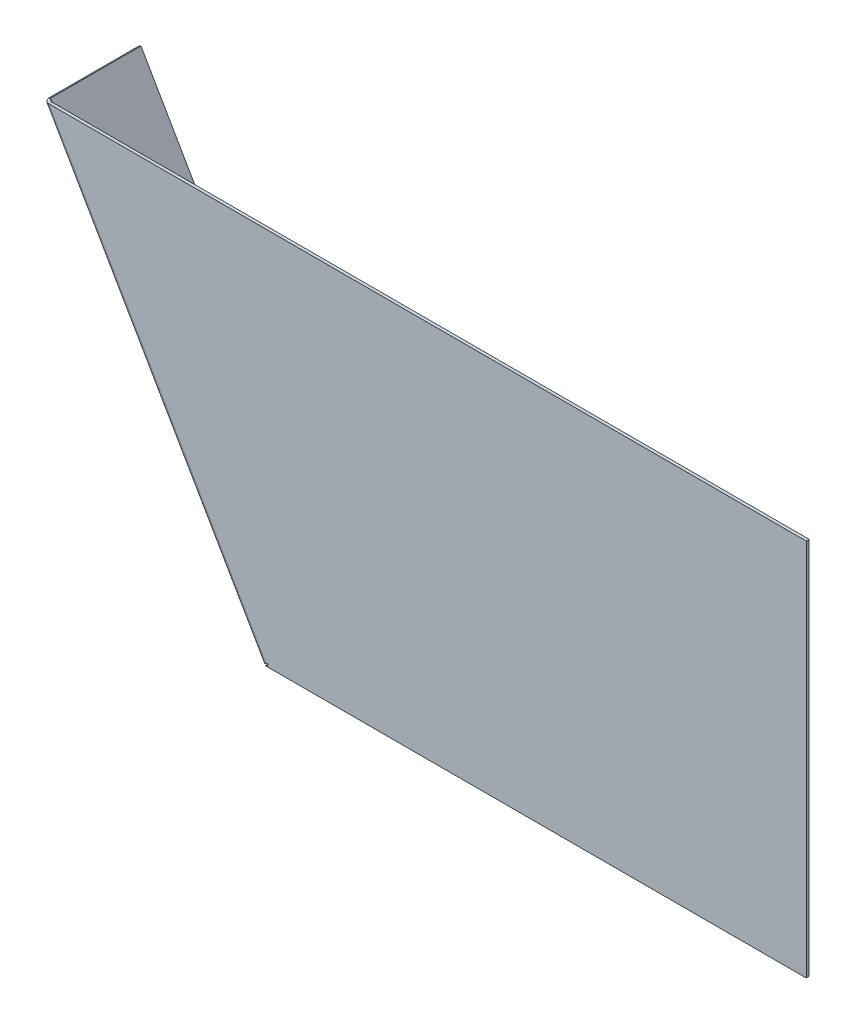
ISO-10303-21;
HEADER;
FILE_DESCRIPTION(('STEP AP214'),'2;1');
FILE_NAME('part.step','',(''),(''),'','','');
FILE_SCHEMA(('AUTOMOTIVE_DESIGN { 1 0 10303 214 1 1 1 1 }'));
ENDSEC;
DATA;
#1=APPLICATION_CONTEXT('core data for automotive mechanical design processes');
#2=APPLICATION_PROTOCOL_DEFINITION('international standard','automotive_design',2000,#1);
#3=PRODUCT_CONTEXT('',#1,'mechanical');
#4=PRODUCT('Part','Part','',(#3));
#5=PRODUCT_RELATED_PRODUCT_CATEGORY('part','',(#4));
#6=PRODUCT_DEFINITION_FORMATION('','',#4);
#7=PRODUCT_DEFINITION_CONTEXT('part definition',#1,'design');
#8=PRODUCT_DEFINITION('design','',#6,#7);
#9=PRODUCT_DEFINITION_SHAPE('','',#8);
#10=(LENGTH_UNIT() NAMED_UNIT(*) SI_UNIT(.MILLI.,.METRE.));
#11=(NAMED_UNIT(*) PLANE_ANGLE_UNIT() SI_UNIT($,.RADIAN.));
#12=(NAMED_UNIT(*) SI_UNIT($,.STERADIAN.) SOLID_ANGLE_UNIT());
#13=UNCERTAINTY_MEASURE_WITH_UNIT(LENGTH_MEASURE(1.E-05),#10,'distance_accuracy_value','');
#14=(GEOMETRIC_REPRESENTATION_CONTEXT(3) GLOBAL_UNCERTAINTY_ASSIGNED_CONTEXT((#13)) GLOBAL_UNIT_ASSIGNED_CONTEXT((#10,
#11,#12)) REPRESENTATION_CONTEXT('',''));
#15=CARTESIAN_POINT('',(0.,0.,0.));
#16=DIRECTION('',(0.,0.,1.));
#17=DIRECTION('',(1.,0.,0.));
#18=AXIS2_PLACEMENT_3D('',#15,#16,#17);
#19=CARTESIAN_POINT('',(0.,203.2,-1.5875));
#20=DIRECTION('',(0.,0.,1.));
#21=DIRECTION('',(1.,0.,0.));
#22=AXIS2_PLACEMENT_3D('',#19,#20,#21);
#23=PLANE('',#22);
#24=DIRECTION('',(-0.50000000000001,0.866025403784433,0.));
#25=VECTOR('',#24,1.);
#26=CARTESIAN_POINT('',(-407.404845058396,204.36205,-1.58749999999848));
#27=LINE('',#26,#25);
#28=CARTESIAN_POINT('',(-406.733935178084,203.2,-1.58749999999848));
#29=VERTEX_POINT('',#28);
#30=CARTESIAN_POINT('',(-290.087270359062,1.16205000000158,-1.58749999999848));
#31=VERTEX_POINT('',#30);
#32=EDGE_CURVE('E204',#29,#31,#27,.F.);
#33=ORIENTED_EDGE('',*,*,#32,.F.);
#34=DIRECTION('',(-1.,0.,0.));
#35=VECTOR('',#34,1.);
#36=CARTESIAN_POINT('',(0.,203.2,-1.5875));
#37=LINE('',#36,#35);
#38=CARTESIAN_POINT('',(0.,203.2,-1.5875));
#39=VERTEX_POINT('',#38);
#40=EDGE_CURVE('E97',#39,#29,#37,.T.);
#41=ORIENTED_EDGE('',*,*,#40,.F.);
#42=DIRECTION('',(0.,-1.,0.));
#43=VECTOR('',#42,1.);
#44=CARTESIAN_POINT('',(0.,203.2,-1.5875));
#45=LINE('',#44,#43);
#46=CARTESIAN_POINT('',(0.,0.,-1.5875));
#47=VERTEX_POINT('',#46);
#48=EDGE_CURVE('E81',#39,#47,#45,.T.);
#49=ORIENTED_EDGE('',*,*,#48,.T.);
#50=DIRECTION('',(-1.,0.,0.));
#51=VECTOR('',#50,1.);
#52=CARTESIAN_POINT('',(0.,0.,-1.5875));
#53=LINE('',#52,#51);
#54=CARTESIAN_POINT('',(-290.5125,0.,-1.58749999999996));
#55=VERTEX_POINT('',#54);
#56=EDGE_CURVE('E95',#47,#55,#53,.T.);
#57=ORIENTED_EDGE('',*,*,#56,.T.);
#58=DIRECTION('',(-0.866025403784453,-0.499999999999976,-4.26581216111212E-13));
#59=VECTOR('',#58,1.);
#60=CARTESIAN_POINT('',(-289.002987694808,0.871517335747679,-1.58749999999848));
#61=LINE('',#60,#59);
#62=CARTESIAN_POINT('',(-289.002987694808,0.871517335747679,-1.58749999999848));
#63=VERTEX_POINT('',#62);
#64=EDGE_CURVE('E72',#63,#55,#61,.T.);
#65=ORIENTED_EDGE('',*,*,#64,.F.);
#66=DIRECTION('',(0.500000000000017,-0.866025403784429,0.));
#67=VECTOR('',#66,1.);
#68=CARTESIAN_POINT('',(-289.399862694808,1.55892500000158,-1.58749999999848));
#69=LINE('',#68,#67);
#70=CARTESIAN_POINT('',(-289.399862694808,1.55892500000158,-1.58749999999848));
#71=VERTEX_POINT('',#70);
#72=EDGE_CURVE('E148',#71,#63,#69,.T.);
#73=ORIENTED_EDGE('',*,*,#72,.F.);
#74=DIRECTION('',(0.866025403784441,0.499999999999996,0.));
#75=VECTOR('',#74,1.);
#76=CARTESIAN_POINT('',(-290.087270359062,1.16205000000158,-1.58749999999848));
#77=LINE('',#76,#75);
#78=EDGE_CURVE('E146',#31,#71,#77,.T.);
#79=ORIENTED_EDGE('',*,*,#78,.F.);
#80=EDGE_LOOP('',(#33,#41,#49,#57,#65,#73,#79));
#81=FACE_BOUND('',#80,.T.);
#82=ADVANCED_FACE('F58',(#81),#23,.F.);
#83=CARTESIAN_POINT('',(0.,203.2,0.));
#84=DIRECTION('',(0.,0.,1.));
#85=DIRECTION('',(1.,0.,0.));
#86=AXIS2_PLACEMENT_3D('',#83,#84,#85);
#87=PLANE('',#86);
#88=DIRECTION('',(-1.,0.,0.));
#89=VECTOR('',#88,1.);
#90=CARTESIAN_POINT('',(0.,203.2,0.));
#91=LINE('',#90,#89);
#92=CARTESIAN_POINT('',(0.,203.2,0.));
#93=VERTEX_POINT('',#92);
#94=CARTESIAN_POINT('',(-406.733935178081,203.200000000002,1.52265353103864E-12));
#95=VERTEX_POINT('',#94);
#96=EDGE_CURVE('E114',#93,#95,#91,.T.);
#97=ORIENTED_EDGE('',*,*,#96,.T.);
#98=DIRECTION('',(-0.50000000000001,0.866025403784433,0.));
#99=VECTOR('',#98,1.);
#100=CARTESIAN_POINT('',(-407.404845058393,204.362050000002,1.52265353103864E-12));
#101=LINE('',#100,#99);
#102=CARTESIAN_POINT('',(-290.087270359062,1.16205000000158,0.));
#103=VERTEX_POINT('',#102);
#104=EDGE_CURVE('E165',#95,#103,#101,.F.);
#105=ORIENTED_EDGE('',*,*,#104,.T.);
#106=DIRECTION('',(0.866025403784441,0.499999999999996,0.));
#107=VECTOR('',#106,1.);
#108=CARTESIAN_POINT('',(14.9631810244996,177.283010222716,0.));
#109=LINE('',#108,#107);
#110=CARTESIAN_POINT('',(-289.399862694808,1.55892500000158,0.));
#111=VERTEX_POINT('',#110);
#112=EDGE_CURVE('E13',#103,#111,#109,.T.);
#113=ORIENTED_EDGE('',*,*,#112,.T.);
#114=DIRECTION('',(0.500000000000017,-0.866025403784429,0.));
#115=VECTOR('',#114,1.);
#116=CARTESIAN_POINT('',(-304.363043719304,27.4759147772779,0.));
#117=LINE('',#116,#115);
#118=CARTESIAN_POINT('',(-289.002987694808,0.871517335747679,0.));
#119=VERTEX_POINT('',#118);
#120=EDGE_CURVE('E65',#111,#119,#117,.T.);
#121=ORIENTED_EDGE('',*,*,#120,.T.);
#122=DIRECTION('',(-0.866025403784453,-0.499999999999976,0.));
#123=VECTOR('',#122,1.);
#124=CARTESIAN_POINT('',(15.3600560245031,176.595602558454,0.));
#125=LINE('',#124,#123);
#126=CARTESIAN_POINT('',(-290.5125,0.,0.));
#127=VERTEX_POINT('',#126);
#128=EDGE_CURVE('E109',#119,#127,#125,.T.);
#129=ORIENTED_EDGE('',*,*,#128,.T.);
#130=DIRECTION('',(-1.,0.,0.));
#131=VECTOR('',#130,1.);
#132=CARTESIAN_POINT('',(0.,0.,0.));
#133=LINE('',#132,#131);
#134=CARTESIAN_POINT('',(0.,0.,0.));
#135=VERTEX_POINT('',#134);
#136=EDGE_CURVE('E108',#135,#127,#133,.T.);
#137=ORIENTED_EDGE('',*,*,#136,.F.);
#138=DIRECTION('',(0.,-1.,0.));
#139=VECTOR('',#138,1.);
#140=CARTESIAN_POINT('',(0.,203.2,0.));
#141=LINE('',#140,#139);
#142=EDGE_CURVE('E99',#93,#135,#141,.T.);
#143=ORIENTED_EDGE('',*,*,#142,.F.);
#144=EDGE_LOOP('',(#97,#105,#113,#121,#129,#137,#143));
#145=FACE_BOUND('',#144,.T.);
#146=ADVANCED_FACE('F124',(#145),#87,.T.);
#147=CARTESIAN_POINT('',(0.,203.2,0.));
#148=DIRECTION('',(0.,-1.,0.));
#149=DIRECTION('',(-1.,0.,0.));
#150=AXIS2_PLACEMENT_3D('',#147,#148,#149);
#151=PLANE('',#150);
#152=DIRECTION('',(1.81335757843741E-12,1.04694248604791E-12,1.));
#153=VECTOR('',#152,1.);
#154=CARTESIAN_POINT('',(-406.733935178084,203.2,-1.58749999999848));
#155=LINE('',#154,#153);
#156=EDGE_CURVE('E163',#29,#95,#155,.T.);
#157=ORIENTED_EDGE('',*,*,#156,.T.);
#158=ORIENTED_EDGE('',*,*,#96,.F.);
#159=DIRECTION('',(0.,0.,1.));
#160=VECTOR('',#159,1.);
#161=CARTESIAN_POINT('',(0.,203.2,-1.5875));
#162=LINE('',#161,#160);
#163=EDGE_CURVE('E100',#39,#93,#162,.T.);
#164=ORIENTED_EDGE('',*,*,#163,.F.);
#165=ORIENTED_EDGE('',*,*,#40,.T.);
#166=EDGE_LOOP('',(#157,#158,#164,#165));
#167=FACE_BOUND('',#166,.T.);
#168=ADVANCED_FACE('F159',(#167),#151,.F.);
#169=CARTESIAN_POINT('',(0.,0.,0.));
#170=DIRECTION('',(0.,-1.,0.));
#171=DIRECTION('',(-1.,0.,0.));
#172=AXIS2_PLACEMENT_3D('',#169,#170,#171);
#173=PLANE('',#172);
#174=ORIENTED_EDGE('',*,*,#136,.T.);
#175=DIRECTION('',(0.,0.,1.));
#176=VECTOR('',#175,1.);
#177=CARTESIAN_POINT('',(-290.5125,0.,-1.58749999999922));
#178=LINE('',#177,#176);
#179=EDGE_CURVE('E107',#55,#127,#178,.T.);
#180=ORIENTED_EDGE('',*,*,#179,.F.);
#181=ORIENTED_EDGE('',*,*,#56,.F.);
#182=DIRECTION('',(0.,0.,1.));
#183=VECTOR('',#182,1.);
#184=CARTESIAN_POINT('',(0.,0.,-1.5875));
#185=LINE('',#184,#183);
#186=EDGE_CURVE('E106',#47,#135,#185,.T.);
#187=ORIENTED_EDGE('',*,*,#186,.T.);
#188=EDGE_LOOP('',(#174,#180,#181,#187));
#189=FACE_BOUND('',#188,.T.);
#190=ADVANCED_FACE('F105',(#189),#173,.T.);
#191=CARTESIAN_POINT('',(0.,203.2,-1.5875));
#192=DIRECTION('',(1.,0.,0.));
#193=DIRECTION('',(0.,0.,-1.));
#194=AXIS2_PLACEMENT_3D('',#191,#192,#193);
#195=PLANE('',#194);
#196=ORIENTED_EDGE('',*,*,#186,.F.);
#197=ORIENTED_EDGE('',*,*,#48,.F.);
#198=ORIENTED_EDGE('',*,*,#163,.T.);
#199=ORIENTED_EDGE('',*,*,#142,.T.);
#200=EDGE_LOOP('',(#196,#197,#198,#199));
#201=FACE_BOUND('',#200,.T.);
#202=ADVANCED_FACE('F111',(#201),#195,.T.);
#203=CARTESIAN_POINT('',(-290.087270359062,1.16205000000158,-1.58749999999848));
#204=DIRECTION('',(0.499999999999996,-0.866025403784441,0.));
#205=DIRECTION('',(0.866025403784441,0.499999999999996,0.));
#206=AXIS2_PLACEMENT_3D('',#203,#204,#205);
#207=PLANE('',#206);
#208=ORIENTED_EDGE('',*,*,#112,.F.);
#209=DIRECTION('',(1.82751210610266E-12,1.05505853548195E-12,1.));
#210=VECTOR('',#209,1.);
#211=CARTESIAN_POINT('',(-290.087270359062,1.16205000000158,-1.58749999999848));
#212=LINE('',#211,#210);
#213=EDGE_CURVE('E197',#31,#103,#212,.T.);
#214=ORIENTED_EDGE('',*,*,#213,.F.);
#215=ORIENTED_EDGE('',*,*,#78,.T.);
#216=DIRECTION('',(0.,0.,1.));
#217=VECTOR('',#216,1.);
#218=CARTESIAN_POINT('',(-289.399862694808,1.55892500000158,-1.58749999999848));
#219=LINE('',#218,#217);
#220=EDGE_CURVE('E138',#71,#111,#219,.T.);
#221=ORIENTED_EDGE('',*,*,#220,.T.);
#222=EDGE_LOOP('',(#208,#214,#215,#221));
#223=FACE_BOUND('',#222,.T.);
#224=ADVANCED_FACE('F143',(#223),#207,.T.);
#225=CARTESIAN_POINT('',(-289.399862694808,1.55892500000158,-1.58749999999848));
#226=DIRECTION('',(-0.866025403784429,-0.500000000000017,0.));
#227=DIRECTION('',(0.500000000000017,-0.866025403784429,0.));
#228=AXIS2_PLACEMENT_3D('',#225,#226,#227);
#229=PLANE('',#228);
#230=ORIENTED_EDGE('',*,*,#120,.F.);
#231=ORIENTED_EDGE('',*,*,#220,.F.);
#232=ORIENTED_EDGE('',*,*,#72,.T.);
#233=DIRECTION('',(0.,0.,1.));
#234=VECTOR('',#233,1.);
#235=CARTESIAN_POINT('',(-289.002987694808,0.871517335747679,-1.58749999999848));
#236=LINE('',#235,#234);
#237=EDGE_CURVE('E140',#63,#119,#236,.T.);
#238=ORIENTED_EDGE('',*,*,#237,.T.);
#239=EDGE_LOOP('',(#230,#231,#232,#238));
#240=FACE_BOUND('',#239,.T.);
#241=ADVANCED_FACE('F135',(#240),#229,.T.);
#242=CARTESIAN_POINT('',(-289.002987694808,0.871517335747679,-1.58749999999848));
#243=DIRECTION('',(-0.499999999999976,0.866025403784453,0.));
#244=DIRECTION('',(-0.866025403784453,-0.499999999999976,0.));
#245=AXIS2_PLACEMENT_3D('',#242,#243,#244);
#246=PLANE('',#245);
#247=ORIENTED_EDGE('',*,*,#128,.F.);
#248=ORIENTED_EDGE('',*,*,#237,.F.);
#249=ORIENTED_EDGE('',*,*,#64,.T.);
#250=ORIENTED_EDGE('',*,*,#179,.T.);
#251=EDGE_LOOP('',(#247,#248,#249,#250));
#252=FACE_BOUND('',#251,.T.);
#253=ADVANCED_FACE('F236',(#252),#246,.T.);
#254=CARTESIAN_POINT('',(-290.087270359063,1.1620500000008,-2.3241));
#255=DIRECTION('',(0.50000000000001,-0.866025403784433,0.));
#256=DIRECTION('',(0.866025403784433,0.50000000000001,0.));
#257=AXIS2_PLACEMENT_3D('',#254,#255,#256);
#258=PLANE('',#257);
#259=DIRECTION('',(0.86602540378444,0.499999999999998,0.));
#260=VECTOR('',#259,1.);
#261=CARTESIAN_POINT('',(-292.1,0.,-2.32409999999999));
#262=LINE('',#261,#260);
#263=CARTESIAN_POINT('',(-290.725184671492,0.793750000000037,-2.3241));
#264=VERTEX_POINT('',#263);
#265=CARTESIAN_POINT('',(-292.1,0.,-2.32409999999999));
#266=VERTEX_POINT('',#265);
#267=EDGE_CURVE('E455',#264,#266,#262,.F.);
#268=ORIENTED_EDGE('',*,*,#267,.F.);
#269=CARTESIAN_POINT('',(-290.087270359063,1.1620500000008,-2.3241));
#270=DIRECTION('',(-0.50000000000001,0.866025403784433,0.));
#271=DIRECTION('',(-0.866025403784433,-0.50000000000001,0.));
#272=AXIS2_PLACEMENT_3D('',#269,#270,#271);
#273=CIRCLE('',#272,0.736600000001521);
#274=EDGE_CURVE('E200',#31,#264,#273,.F.);
#275=ORIENTED_EDGE('',*,*,#274,.F.);
#276=ORIENTED_EDGE('',*,*,#213,.T.);
#277=CARTESIAN_POINT('',(-290.087270359063,1.1620500000008,-2.3241));
#278=DIRECTION('',(-0.50000000000001,0.866025403784433,0.));
#279=DIRECTION('',(-0.866025403784433,-0.50000000000001,0.));
#280=AXIS2_PLACEMENT_3D('',#277,#278,#279);
#281=CIRCLE('',#280,2.32410000000152);
#282=EDGE_CURVE('E187',#103,#266,#281,.F.);
#283=ORIENTED_EDGE('',*,*,#282,.T.);
#284=EDGE_LOOP('',(#268,#275,#276,#283));
#285=FACE_BOUND('',#284,.T.);
#286=ADVANCED_FACE('F198',(#285),#258,.T.);
#287=CARTESIAN_POINT('',(-409.431322852619,203.192062499998,-2.32409999999999));
#288=CARTESIAN_POINT('',(-409.375404769558,203.095209539075,-2.0177492570626));
#289=CARTESIAN_POINT('',(-409.266760746459,203.028839142955,-1.71161649429517));
#290=CARTESIAN_POINT('',(-408.951917144519,202.952380847954,-1.14564417640438));
#291=CARTESIAN_POINT('',(-408.745806373828,202.942262290229,-0.88607603892409));
#292=CARTESIAN_POINT('',(-408.258846243088,202.965175519463,-0.452899580456306));
#293=CARTESIAN_POINT('',(-407.978144485324,202.998122088203,-0.279461695907748));
#294=CARTESIAN_POINT('',(-407.376179766806,203.087433247149,-0.0450282859104728));
#295=CARTESIAN_POINT('',(-407.055160786994,203.143677589457,0.0158750000021699));
#296=CARTESIAN_POINT('',(-406.733935178081,203.200000000002,0.0158750000015227));
#297=CARTESIAN_POINT('',(-409.417574699334,203.199999999998,-2.32409999999999));
#298=CARTESIAN_POINT('',(-409.36165666209,203.103147118432,-2.01982769879192));
#299=CARTESIAN_POINT('',(-409.253370420805,203.036570051076,-1.71577174195938));
#300=CARTESIAN_POINT('',(-408.939904195314,202.959316527412,-1.15363912771778));
#301=CARTESIAN_POINT('',(-408.734812431502,202.94860964579,-0.895831968103703));
#302=CARTESIAN_POINT('',(-408.250397360581,202.970053484053,-0.465594291579389));
#303=CARTESIAN_POINT('',(-407.971220654385,203.00211956386,-0.293333054822883));
#304=CARTESIAN_POINT('',(-407.37258121677,203.089510870981,-0.0604901021525897));
#305=CARTESIAN_POINT('',(-407.053360757839,203.144716730964,2.16554689060597E-12));
#306=CARTESIAN_POINT('',(-406.733935178081,203.200000000002,1.52265353103864E-12));
#307=CARTESIAN_POINT('',(-408.042759370826,203.993749999998,-2.3241));
#308=CARTESIAN_POINT('',(-407.986845915301,203.896905054202,-2.22767187172308));
#309=CARTESIAN_POINT('',(-407.914337855373,203.809660863182,-2.13129650838029));
#310=CARTESIAN_POINT('',(-407.738609274763,203.652884473168,-1.95313425905757));
#311=CARTESIAN_POINT('',(-407.635418198874,203.583345201944,-1.87142488606501));
#312=CARTESIAN_POINT('',(-407.405509109876,203.457849943032,-1.73506540388771));
#313=CARTESIAN_POINT('',(-407.278837560445,203.401867129529,-1.68046894633638));
#314=CARTESIAN_POINT('',(-407.012726213151,203.29727325419,-1.60667172636428));
#315=CARTESIAN_POINT('',(-406.873357842337,203.248630881658,-1.58749999999827));
#316=CARTESIAN_POINT('',(-406.733935178084,203.2,-1.58749999999848));
#317=CARTESIAN_POINT('',(-408.028873736008,204.001766874998,-2.3241));
#318=CARTESIAN_POINT('',(-407.972960326758,203.904922009353,-2.22977109786969));
#319=CARTESIAN_POINT('',(-407.900813626463,203.817469080384,-2.13549330852114));
#320=CARTESIAN_POINT('',(-407.726476196066,203.65988950942,-1.9612091598841));
#321=CARTESIAN_POINT('',(-407.624314317125,203.589756031061,-1.88127837453642));
#322=CARTESIAN_POINT('',(-407.396975738544,203.462776687268,-1.74788706212203));
#323=CARTESIAN_POINT('',(-407.271844491196,203.405904579942,-1.69447901884067));
#324=CARTESIAN_POINT('',(-407.009091677614,203.29937165426,-1.62228816076882));
#325=CARTESIAN_POINT('',(-406.87153981289,203.24968041458,-1.60353374999828));
#326=CARTESIAN_POINT('',(-406.733935178084,203.2,-1.60353374999848));
#327=B_SPLINE_SURFACE_WITH_KNOTS('',1,3,((#287,#288,#289,#290,#291,#292,#293,#294,#295,#296),
(#297,#298,#299,#300,#301,#302,#303,#304,#305,#306),(#307,#308,#309,#310,#311,#312,#313,#314,
#315,#316),(#317,#318,#319,#320,#321,#322,#323,#324,#325,#326)),.UNSPECIFIED.,.F.,.F.,.F.,(2,1,
1,2),(4,2,2,2,4),(-0.01,0.,1.,1.0101),(0.,0.25,0.5,0.75,1.),.UNSPECIFIED.);
#328=CARTESIAN_POINT('',(-408.042759370826,203.993749999998,-2.3241));
#329=CARTESIAN_POINT('',(-408.024315402968,203.961779986412,-2.29227557104422));
#330=CARTESIAN_POINT('',(-408.004066196748,203.930855522234,-2.2604525022114));
#331=CARTESIAN_POINT('',(-407.9600333055,203.871053188224,-2.19734131871956));
#332=CARTESIAN_POINT('',(-407.936250026115,203.842175084071,-2.16605314312412));
#333=CARTESIAN_POINT('',(-407.885313273307,203.786514788209,-2.10464800978774));
#334=CARTESIAN_POINT('',(-407.858172337799,203.759725373802,-2.07452721528001));
#335=CARTESIAN_POINT('',(-407.800617044079,203.708048619856,-2.01584340460018));
#336=CARTESIAN_POINT('',(-407.770202783361,203.683161223704,-1.98728034207012));
#337=CARTESIAN_POINT('',(-407.674041006074,203.61097535318,-1.90440647558404));
#338=CARTESIAN_POINT('',(-407.60355889691,203.566350714542,-1.85313749062456));
#339=CARTESIAN_POINT('',(-407.452306384562,203.483035263809,-1.76226972940406));
#340=CARTESIAN_POINT('',(-407.371535100473,203.444344960407,-1.72267195333245));
#341=CARTESIAN_POINT('',(-407.243788781616,203.388995966183,-1.67354960316239));
#342=CARTESIAN_POINT('',(-407.199445863743,203.370761177292,-1.658758387073));
#343=CARTESIAN_POINT('',(-407.10926976403,203.335137752644,-1.63319211733162));
#344=CARTESIAN_POINT('',(-407.063436485119,203.317749172187,-1.62241732585245));
#345=CARTESIAN_POINT('',(-406.970585269515,203.28348700693,-1.60505571420439));
#346=CARTESIAN_POINT('',(-406.923563362296,203.266615732621,-1.59848563706498));
#347=CARTESIAN_POINT('',(-406.829007068519,203.233163497276,-1.58970066926898));
#348=CARTESIAN_POINT('',(-406.781472630129,203.216582566057,-1.58748622332144));
#349=CARTESIAN_POINT('',(-406.733935178084,203.2,-1.58749999999848));
#350=B_SPLINE_CURVE_WITH_KNOTS('',3,(#328,#329,#330,#331,#332,#333,#334,#335,#336,#337,#338,
#339,#340,#341,#342,#343,#344,#345,#346,#347,#348,#349),.UNSPECIFIED.,.F.,.F.,(4,2,2,2,2,2,2,2,
2,2,4),(0.,0.146154486813948,0.292292210856949,0.437899837715701,0.5835031289381,
0.875753899908433,1.16802970866177,1.31839529007452,1.46877068490881,1.61974120375171,
1.77072713585325),.UNSPECIFIED.);
#351=CARTESIAN_POINT('',(-408.042759370826,203.993749999998,-2.3241));
#352=VERTEX_POINT('',#351);
#353=EDGE_CURVE('E214',#352,#29,#350,.T.);
#354=DIRECTION('',(0.86602540378444,0.499999999999998,0.));
#355=VECTOR('',#354,1.);
#356=CARTESIAN_POINT('',(-408.042759370824,203.99375,-2.3241));
#357=LINE('',#356,#355);
#358=CARTESIAN_POINT('',(-409.417574699331,203.2,-2.32409999999999));
#359=VERTEX_POINT('',#358);
#360=EDGE_CURVE('E451',#352,#359,#357,.F.);
#361=CARTESIAN_POINT('',(-409.417574699334,203.199999999998,-2.32409999999999));
#362=CARTESIAN_POINT('',(-409.40587944072,203.179741592527,-2.26046145414905));
#363=CARTESIAN_POINT('',(-409.391922802984,203.160799723918,-2.19684659460006));
#364=CARTESIAN_POINT('',(-409.359504358339,203.125520893511,-2.07005170304697));
#365=CARTESIAN_POINT('',(-409.341043030582,203.109183654973,-2.00687162553084));
#366=CARTESIAN_POINT('',(-409.278955745898,203.064053722249,-1.81864071222444));
#367=CARTESIAN_POINT('',(-409.228608468361,203.039111788895,-1.69480027568739));
#368=CARTESIAN_POINT('',(-409.105160343397,202.997258588833,-1.44250764332334));
#369=CARTESIAN_POINT('',(-409.030358587337,202.981329256363,-1.31472600259536));
#370=CARTESIAN_POINT('',(-408.861767748849,202.960444527713,-1.07138698204685));
#371=CARTESIAN_POINT('',(-408.767980272412,202.955488203755,-0.955828569528408));
#372=CARTESIAN_POINT('',(-408.563613557285,202.955264856026,-0.740661320341951));
#373=CARTESIAN_POINT('',(-408.453034977698,202.959997452025,-0.6410518579434));
#374=CARTESIAN_POINT('',(-408.217782157179,202.977588220607,-0.460953676670002));
#375=CARTESIAN_POINT('',(-408.093103523313,202.990448931297,-0.380470941166388));
#376=CARTESIAN_POINT('',(-407.832846294747,203.022441488109,-0.241239183972503));
#377=CARTESIAN_POINT('',(-407.69726337575,203.041575831502,-0.182498836877619));
#378=CARTESIAN_POINT('',(-407.418843269777,203.084070343852,-0.0887367985231418));
#379=CARTESIAN_POINT('',(-407.276014317264,203.107425789993,-0.0536888045558067));
#380=CARTESIAN_POINT('',(-407.065708513724,203.142877537931,-0.0206895031265004));
#381=CARTESIAN_POINT('',(-406.999509692416,203.154186859326,-0.0129295787451232));
#382=CARTESIAN_POINT('',(-406.866862401488,203.176996216087,-0.0025900938022239));
#383=CARTESIAN_POINT('',(-406.800414579393,203.188495879292,-1.40692364507551E-06));
#384=CARTESIAN_POINT('',(-406.733935178081,203.200000000002,1.52265353103864E-12));
#385=B_SPLINE_CURVE_WITH_KNOTS('',3,(#361,#362,#363,#364,#365,#366,#367,#368,#369,#370,#371,
#372,#373,#374,#375,#376,#377,#378,#379,#380,#381,#382,#383,#384),.UNSPECIFIED.,.F.,.F.,(4,2,2,
2,2,2,2,2,2,2,2,4),(0.,0.203303503959254,0.406585392561959,0.812836886622673,1.25748866275526,
1.70210284175377,2.14669957277777,2.59143520346169,3.03634808026065,3.48076621021582,
3.68341341554487,3.88570266741921),.UNSPECIFIED.);
#386=EDGE_CURVE('E207',#359,#95,#385,.T.);
#387=ORIENTED_EDGE('',*,*,#353,.F.);
#388=ORIENTED_EDGE('',*,*,#360,.T.);
#389=ORIENTED_EDGE('',*,*,#386,.T.);
#390=ORIENTED_EDGE('',*,*,#156,.F.);
#391=EDGE_LOOP('',(#387,#388,#389,#390));
#392=FACE_BOUND('',#391,.T.);
#393=ADVANCED_FACE('F220',(#392),#327,.F.);
#394=CARTESIAN_POINT('',(-407.404845058397,204.362049999999,-2.3241));
#395=DIRECTION('',(-0.50000000000001,0.866025403784433,0.));
#396=DIRECTION('',(-0.866025403784433,-0.50000000000001,0.));
#397=AXIS2_PLACEMENT_3D('',#394,#395,#396);
#398=CYLINDRICAL_SURFACE('',#397,2.32410000000152);
#399=ORIENTED_EDGE('',*,*,#104,.F.);
#400=ORIENTED_EDGE('',*,*,#386,.F.);
#401=DIRECTION('',(-0.499999999999998,0.86602540378444,0.));
#402=VECTOR('',#401,1.);
#403=CARTESIAN_POINT('',(-292.1,0.,-2.32409999999999));
#404=LINE('',#403,#402);
#405=EDGE_CURVE('E191',#359,#266,#404,.F.);
#406=ORIENTED_EDGE('',*,*,#405,.T.);
#407=ORIENTED_EDGE('',*,*,#282,.F.);
#408=EDGE_LOOP('',(#399,#400,#406,#407));
#409=FACE_BOUND('',#408,.T.);
#410=ADVANCED_FACE('F189',(#409),#398,.T.);
#411=CARTESIAN_POINT('',(-407.404845058397,204.362049999999,-2.3241));
#412=DIRECTION('',(-0.50000000000001,0.866025403784433,0.));
#413=DIRECTION('',(-0.866025403784433,-0.50000000000001,0.));
#414=AXIS2_PLACEMENT_3D('',#411,#412,#413);
#415=CYLINDRICAL_SURFACE('',#414,0.736600000001521);
#416=ORIENTED_EDGE('',*,*,#32,.T.);
#417=ORIENTED_EDGE('',*,*,#274,.T.);
#418=DIRECTION('',(-0.499999999999998,0.86602540378444,0.));
#419=VECTOR('',#418,1.);
#420=CARTESIAN_POINT('',(-290.725184671492,0.793749999999982,-2.3241));
#421=LINE('',#420,#419);
#422=EDGE_CURVE('E440',#264,#352,#421,.T.);
#423=ORIENTED_EDGE('',*,*,#422,.T.);
#424=ORIENTED_EDGE('',*,*,#353,.T.);
#425=EDGE_LOOP('',(#416,#417,#423,#424));
#426=FACE_BOUND('',#425,.T.);
#427=ADVANCED_FACE('F229',(#426),#415,.F.);
#428=CARTESIAN_POINT('',(-409.417574699332,203.2,-50.8));
#429=DIRECTION('',(0.499999999999998,-0.86602540378444,0.));
#430=DIRECTION('',(0.86602540378444,0.499999999999998,0.));
#431=AXIS2_PLACEMENT_3D('',#428,#429,#430);
#432=PLANE('',#431);
#433=ORIENTED_EDGE('',*,*,#360,.F.);
#434=DIRECTION('',(0.,0.,1.));
#435=VECTOR('',#434,1.);
#436=CARTESIAN_POINT('',(-408.042759370824,203.99375,-50.8));
#437=LINE('',#436,#435);
#438=CARTESIAN_POINT('',(-408.042759370824,203.99375,-50.8));
#439=VERTEX_POINT('',#438);
#440=EDGE_CURVE('E433',#352,#439,#437,.F.);
#441=ORIENTED_EDGE('',*,*,#440,.T.);
#442=DIRECTION('',(0.86602540378444,0.499999999999998,0.));
#443=VECTOR('',#442,1.);
#444=CARTESIAN_POINT('',(-409.417574699332,203.2,-50.8));
#445=LINE('',#444,#443);
#446=CARTESIAN_POINT('',(-409.417574699332,203.2,-50.8));
#447=VERTEX_POINT('',#446);
#448=EDGE_CURVE('E427',#447,#439,#445,.T.);
#449=ORIENTED_EDGE('',*,*,#448,.F.);
#450=DIRECTION('',(0.,0.,-1.));
#451=VECTOR('',#450,1.);
#452=CARTESIAN_POINT('',(-409.417574699331,203.2,8.61247722366252E-13));
#453=LINE('',#452,#451);
#454=EDGE_CURVE('E441',#359,#447,#453,.T.);
#455=ORIENTED_EDGE('',*,*,#454,.F.);
#456=EDGE_LOOP('',(#433,#441,#449,#455));
#457=FACE_BOUND('',#456,.T.);
#458=ADVANCED_FACE('F230',(#457),#432,.F.);
#459=CARTESIAN_POINT('',(-292.1,0.,-1.58749999999999));
#460=DIRECTION('',(-0.499999999999998,0.86602540378444,0.));
#461=DIRECTION('',(-0.86602540378444,-0.499999999999998,0.));
#462=AXIS2_PLACEMENT_3D('',#459,#460,#461);
#463=PLANE('',#462);
#464=ORIENTED_EDGE('',*,*,#267,.T.);
#465=DIRECTION('',(0.,0.,1.));
#466=VECTOR('',#465,1.);
#467=CARTESIAN_POINT('',(-292.1,0.,9.9399935500136E-13));
#468=LINE('',#467,#466);
#469=CARTESIAN_POINT('',(-292.1,0.,-50.8));
#470=VERTEX_POINT('',#469);
#471=EDGE_CURVE('E437',#470,#266,#468,.T.);
#472=ORIENTED_EDGE('',*,*,#471,.F.);
#473=DIRECTION('',(0.86602540378444,0.499999999999998,0.));
#474=VECTOR('',#473,1.);
#475=CARTESIAN_POINT('',(-292.1,0.,-50.8));
#476=LINE('',#475,#474);
#477=CARTESIAN_POINT('',(-290.725184671492,0.793749999999921,-50.8));
#478=VERTEX_POINT('',#477);
#479=EDGE_CURVE('E423',#470,#478,#476,.T.);
#480=ORIENTED_EDGE('',*,*,#479,.T.);
#481=DIRECTION('',(0.,0.,-1.));
#482=VECTOR('',#481,1.);
#483=CARTESIAN_POINT('',(-290.725184671492,0.793750000000004,-1.5875));
#484=LINE('',#483,#482);
#485=EDGE_CURVE('E432',#478,#264,#484,.F.);
#486=ORIENTED_EDGE('',*,*,#485,.T.);
#487=EDGE_LOOP('',(#464,#472,#480,#486));
#488=FACE_BOUND('',#487,.T.);
#489=ADVANCED_FACE('F302',(#488),#463,.F.);
#490=CARTESIAN_POINT('',(-219.075000000001,-126.483010222717,9.60892335585545E-13));
#491=DIRECTION('',(0.86602540378444,0.499999999999998,0.));
#492=DIRECTION('',(-0.499999999999998,0.86602540378444,0.));
#493=AXIS2_PLACEMENT_3D('',#490,#491,#492);
#494=PLANE('',#493);
#495=ORIENTED_EDGE('',*,*,#405,.F.);
#496=ORIENTED_EDGE('',*,*,#454,.T.);
#497=DIRECTION('',(0.499999999999998,-0.86602540378444,0.));
#498=VECTOR('',#497,1.);
#499=CARTESIAN_POINT('',(-219.075000000001,-126.483010222717,-50.8));
#500=LINE('',#499,#498);
#501=EDGE_CURVE('E444',#447,#470,#500,.T.);
#502=ORIENTED_EDGE('',*,*,#501,.T.);
#503=ORIENTED_EDGE('',*,*,#471,.T.);
#504=EDGE_LOOP('',(#495,#496,#502,#503));
#505=FACE_BOUND('',#504,.T.);
#506=ADVANCED_FACE('F312',(#505),#494,.F.);
#507=CARTESIAN_POINT('',(-217.700184671493,-125.689260222717,9.55181242640984E-13));
#508=DIRECTION('',(0.86602540378444,0.499999999999998,0.));
#509=DIRECTION('',(-0.499999999999998,0.86602540378444,0.));
#510=AXIS2_PLACEMENT_3D('',#507,#508,#509);
#511=PLANE('',#510);
#512=ORIENTED_EDGE('',*,*,#440,.F.);
#513=ORIENTED_EDGE('',*,*,#422,.F.);
#514=ORIENTED_EDGE('',*,*,#485,.F.);
#515=DIRECTION('',(-0.499999999999998,0.86602540378444,0.));
#516=VECTOR('',#515,1.);
#517=CARTESIAN_POINT('',(-290.725184671492,0.793749999999918,-50.8));
#518=LINE('',#517,#516);
#519=EDGE_CURVE('E419',#439,#478,#518,.F.);
#520=ORIENTED_EDGE('',*,*,#519,.F.);
#521=EDGE_LOOP('',(#512,#513,#514,#520));
#522=FACE_BOUND('',#521,.T.);
#523=ADVANCED_FACE('F323',(#522),#511,.T.);
#524=CARTESIAN_POINT('',(-292.1,0.,-50.8));
#525=DIRECTION('',(0.,0.,1.));
#526=DIRECTION('',(1.,0.,0.));
#527=AXIS2_PLACEMENT_3D('',#524,#525,#526);
#528=PLANE('',#527);
#529=ORIENTED_EDGE('',*,*,#519,.T.);
#530=ORIENTED_EDGE('',*,*,#479,.F.);
#531=ORIENTED_EDGE('',*,*,#501,.F.);
#532=ORIENTED_EDGE('',*,*,#448,.T.);
#533=EDGE_LOOP('',(#529,#530,#531,#532));
#534=FACE_BOUND('',#533,.T.);
#535=ADVANCED_FACE('F334',(#534),#528,.F.);
#536=CLOSED_SHELL('',(#82,#146,#168,#190,#202,#224,#241,#253,#286,#393,#410,#427,#458,#489,#506,
#523,#535));
#537=MANIFOLD_SOLID_BREP('B2',#536);
#538=ADVANCED_BREP_SHAPE_REPRESENTATION('',(#18,#537),#14);
#539=SHAPE_DEFINITION_REPRESENTATION(#9,#538);
ENDSEC;
END-ISO-10303-21;
